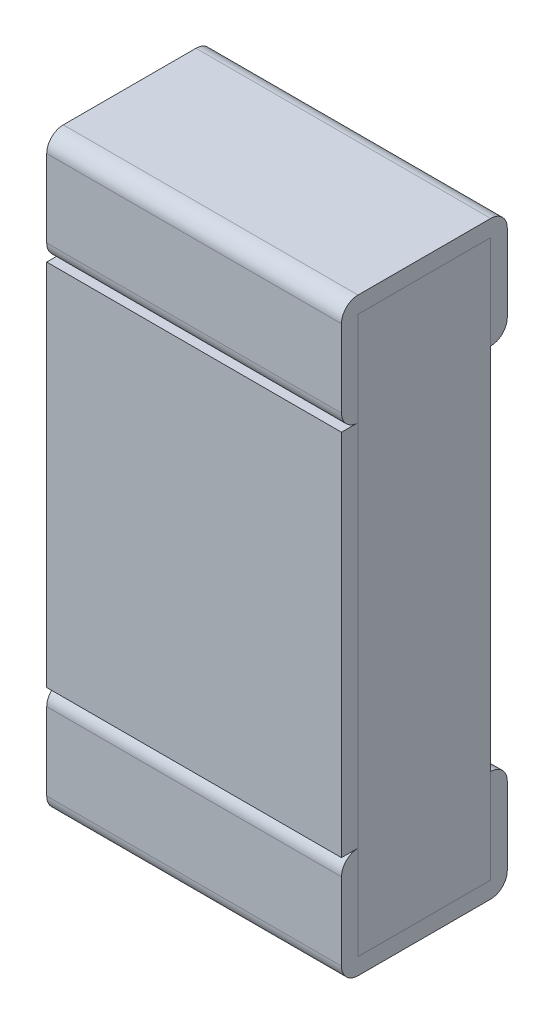
ISO-10303-21;
HEADER;
FILE_DESCRIPTION(('STEP AP214'),'2;1');
FILE_NAME('part.step','',(''),(''),'','','');
FILE_SCHEMA(('AUTOMOTIVE_DESIGN { 1 0 10303 214 1 1 1 1 }'));
ENDSEC;
DATA;
#1=APPLICATION_CONTEXT('core data for automotive mechanical design processes');
#2=APPLICATION_PROTOCOL_DEFINITION('international standard','automotive_design',2000,#1);
#3=PRODUCT_CONTEXT('',#1,'mechanical');
#4=PRODUCT('Part','Part','',(#3));
#5=PRODUCT_RELATED_PRODUCT_CATEGORY('part','',(#4));
#6=PRODUCT_DEFINITION_FORMATION('','',#4);
#7=PRODUCT_DEFINITION_CONTEXT('part definition',#1,'design');
#8=PRODUCT_DEFINITION('design','',#6,#7);
#9=PRODUCT_DEFINITION_SHAPE('','',#8);
#10=(LENGTH_UNIT() NAMED_UNIT(*) SI_UNIT(.MILLI.,.METRE.));
#11=(NAMED_UNIT(*) PLANE_ANGLE_UNIT() SI_UNIT($,.RADIAN.));
#12=(NAMED_UNIT(*) SI_UNIT($,.STERADIAN.) SOLID_ANGLE_UNIT());
#13=UNCERTAINTY_MEASURE_WITH_UNIT(LENGTH_MEASURE(1.E-05),#10,'distance_accuracy_value','');
#14=(GEOMETRIC_REPRESENTATION_CONTEXT(3) GLOBAL_UNCERTAINTY_ASSIGNED_CONTEXT((#13)) GLOBAL_UNIT_ASSIGNED_CONTEXT((#10,
#11,#12)) REPRESENTATION_CONTEXT('',''));
#15=CARTESIAN_POINT('',(0.,0.,0.));
#16=DIRECTION('',(0.,0.,1.));
#17=DIRECTION('',(1.,0.,0.));
#18=AXIS2_PLACEMENT_3D('',#15,#16,#17);
#19=CARTESIAN_POINT('',(144.404744279938,105.48804329235,142.661582908599));
#20=DIRECTION('',(0.,0.,1.));
#21=DIRECTION('',(1.,0.,0.));
#22=AXIS2_PLACEMENT_3D('',#19,#20,#21);
#23=PLANE('',#22);
#24=DIRECTION('',(-1.,0.,0.));
#25=VECTOR('',#24,1.);
#26=CARTESIAN_POINT('',(144.404744279938,105.48804329235,142.661582908599));
#27=LINE('',#26,#25);
#28=CARTESIAN_POINT('',(144.404744279938,105.48804329235,142.661582908599));
#29=VERTEX_POINT('',#28);
#30=CARTESIAN_POINT('',(143.604744279938,105.48804329235,142.661582908599));
#31=VERTEX_POINT('',#30);
#32=EDGE_CURVE('E67',#29,#31,#27,.T.);
#33=ORIENTED_EDGE('',*,*,#32,.F.);
#34=DIRECTION('',(0.,1.,0.));
#35=VECTOR('',#34,1.);
#36=CARTESIAN_POINT('',(144.404744279938,105.48804329235,142.661582908599));
#37=LINE('',#36,#35);
#38=CARTESIAN_POINT('',(144.404744279938,106.48804329235,142.661582908599));
#39=VERTEX_POINT('',#38);
#40=EDGE_CURVE('E11',#29,#39,#37,.T.);
#41=ORIENTED_EDGE('',*,*,#40,.T.);
#42=DIRECTION('',(-1.,0.,0.));
#43=VECTOR('',#42,1.);
#44=CARTESIAN_POINT('',(144.404744279938,106.48804329235,142.661582908599));
#45=LINE('',#44,#43);
#46=CARTESIAN_POINT('',(143.604744279938,106.48804329235,142.661582908599));
#47=VERTEX_POINT('',#46);
#48=EDGE_CURVE('E55',#39,#47,#45,.T.);
#49=ORIENTED_EDGE('',*,*,#48,.T.);
#50=DIRECTION('',(0.,1.,0.));
#51=VECTOR('',#50,1.);
#52=CARTESIAN_POINT('',(143.604744279938,105.48804329235,142.661582908599));
#53=LINE('',#52,#51);
#54=EDGE_CURVE('E413',#31,#47,#53,.T.);
#55=ORIENTED_EDGE('',*,*,#54,.F.);
#56=EDGE_LOOP('',(#33,#41,#49,#55));
#57=FACE_BOUND('',#56,.T.);
#58=ADVANCED_FACE('F44',(#57),#23,.T.);
#59=CARTESIAN_POINT('',(144.404744279938,106.48804329235,142.616582908599));
#60=DIRECTION('',(0.,1.,0.));
#61=DIRECTION('',(1.,0.,0.));
#62=AXIS2_PLACEMENT_3D('',#59,#60,#61);
#63=PLANE('',#62);
#64=DIRECTION('',(0.,0.,1.));
#65=VECTOR('',#64,1.);
#66=CARTESIAN_POINT('',(144.404744279938,106.48804329235,142.616582908599));
#67=LINE('',#66,#65);
#68=CARTESIAN_POINT('',(144.404744279938,106.48804329235,142.616582908599));
#69=VERTEX_POINT('',#68);
#70=EDGE_CURVE('E332',#69,#39,#67,.T.);
#71=ORIENTED_EDGE('',*,*,#70,.F.);
#72=DIRECTION('',(-1.,0.,0.));
#73=VECTOR('',#72,1.);
#74=CARTESIAN_POINT('',(144.404744279938,106.48804329235,142.616582908599));
#75=LINE('',#74,#73);
#76=CARTESIAN_POINT('',(143.604744279938,106.48804329235,142.616582908599));
#77=VERTEX_POINT('',#76);
#78=EDGE_CURVE('E403',#69,#77,#75,.T.);
#79=ORIENTED_EDGE('',*,*,#78,.T.);
#80=DIRECTION('',(0.,0.,1.));
#81=VECTOR('',#80,1.);
#82=CARTESIAN_POINT('',(143.604744279938,106.48804329235,142.616582908599));
#83=LINE('',#82,#81);
#84=EDGE_CURVE('E399',#77,#47,#83,.T.);
#85=ORIENTED_EDGE('',*,*,#84,.T.);
#86=ORIENTED_EDGE('',*,*,#48,.F.);
#87=EDGE_LOOP('',(#71,#79,#85,#86));
#88=FACE_BOUND('',#87,.T.);
#89=ADVANCED_FACE('F517',(#88),#63,.T.);
#90=CARTESIAN_POINT('',(144.404744279938,106.53304329235,142.616582908599));
#91=DIRECTION('',(-1.,0.,0.));
#92=DIRECTION('',(0.,-1.,0.));
#93=AXIS2_PLACEMENT_3D('',#90,#91,#92);
#94=CYLINDRICAL_SURFACE('',#93,0.0450000000000034);
#95=CARTESIAN_POINT('',(144.404744279938,106.53304329235,142.616582908599));
#96=DIRECTION('',(-1.,0.,0.));
#97=DIRECTION('',(0.,0.,1.));
#98=AXIS2_PLACEMENT_3D('',#95,#96,#97);
#99=CIRCLE('',#98,0.0449999999999895);
#100=CARTESIAN_POINT('',(144.404744279938,106.53304329235,142.661582908599));
#101=VERTEX_POINT('',#100);
#102=EDGE_CURVE('E260',#69,#101,#99,.T.);
#103=ORIENTED_EDGE('',*,*,#102,.T.);
#104=DIRECTION('',(-1.,0.,0.));
#105=VECTOR('',#104,1.);
#106=CARTESIAN_POINT('',(144.404744279938,106.53304329235,142.661582908599));
#107=LINE('',#106,#105);
#108=CARTESIAN_POINT('',(143.604744279938,106.53304329235,142.661582908599));
#109=VERTEX_POINT('',#108);
#110=EDGE_CURVE('E312',#101,#109,#107,.T.);
#111=ORIENTED_EDGE('',*,*,#110,.T.);
#112=CARTESIAN_POINT('',(143.604744279938,106.53304329235,142.616582908599));
#113=DIRECTION('',(-1.,0.,0.));
#114=DIRECTION('',(0.,0.,1.));
#115=AXIS2_PLACEMENT_3D('',#112,#113,#114);
#116=CIRCLE('',#115,0.0449999999999895);
#117=EDGE_CURVE('E392',#77,#109,#116,.T.);
#118=ORIENTED_EDGE('',*,*,#117,.F.);
#119=ORIENTED_EDGE('',*,*,#78,.F.);
#120=EDGE_LOOP('',(#103,#111,#118,#119));
#121=FACE_BOUND('',#120,.T.);
#122=ADVANCED_FACE('F514',(#121),#94,.T.);
#123=CARTESIAN_POINT('',(144.404744279938,106.48804329235,142.661582908599));
#124=DIRECTION('',(0.,0.,1.));
#125=DIRECTION('',(1.,0.,0.));
#126=AXIS2_PLACEMENT_3D('',#123,#124,#125);
#127=PLANE('',#126);
#128=DIRECTION('',(0.,1.,0.));
#129=VECTOR('',#128,1.);
#130=CARTESIAN_POINT('',(143.604744279938,106.48804329235,142.661582908599));
#131=LINE('',#130,#129);
#132=CARTESIAN_POINT('',(143.604744279938,106.74304329235,142.661582908599));
#133=VERTEX_POINT('',#132);
#134=EDGE_CURVE('E396',#109,#133,#131,.T.);
#135=ORIENTED_EDGE('',*,*,#134,.F.);
#136=ORIENTED_EDGE('',*,*,#110,.F.);
#137=DIRECTION('',(0.,1.,0.));
#138=VECTOR('',#137,1.);
#139=CARTESIAN_POINT('',(144.404744279938,106.48804329235,142.661582908599));
#140=LINE('',#139,#138);
#141=CARTESIAN_POINT('',(144.404744279938,106.74304329235,142.661582908599));
#142=VERTEX_POINT('',#141);
#143=EDGE_CURVE('E290',#101,#142,#140,.T.);
#144=ORIENTED_EDGE('',*,*,#143,.T.);
#145=DIRECTION('',(-1.,0.,0.));
#146=VECTOR('',#145,1.);
#147=CARTESIAN_POINT('',(144.404744279938,106.74304329235,142.661582908599));
#148=LINE('',#147,#146);
#149=EDGE_CURVE('E287',#142,#133,#148,.T.);
#150=ORIENTED_EDGE('',*,*,#149,.T.);
#151=EDGE_LOOP('',(#135,#136,#144,#150));
#152=FACE_BOUND('',#151,.T.);
#153=ADVANCED_FACE('F500',(#152),#127,.T.);
#154=CARTESIAN_POINT('',(144.404744279938,106.74304329235,142.616582908599));
#155=DIRECTION('',(-1.,0.,0.));
#156=DIRECTION('',(0.,1.,0.));
#157=AXIS2_PLACEMENT_3D('',#154,#155,#156);
#158=CYLINDRICAL_SURFACE('',#157,0.0450000000000034);
#159=DIRECTION('',(-1.,0.,0.));
#160=VECTOR('',#159,1.);
#161=CARTESIAN_POINT('',(144.404744279938,106.78804329235,142.616582908599));
#162=LINE('',#161,#160);
#163=CARTESIAN_POINT('',(144.404744279938,106.78804329235,142.616582908599));
#164=VERTEX_POINT('',#163);
#165=CARTESIAN_POINT('',(143.604744279938,106.78804329235,142.616582908599));
#166=VERTEX_POINT('',#165);
#167=EDGE_CURVE('E291',#164,#166,#162,.T.);
#168=ORIENTED_EDGE('',*,*,#167,.T.);
#169=CARTESIAN_POINT('',(143.604744279938,106.74304329235,142.616582908599));
#170=DIRECTION('',(1.,0.,0.));
#171=DIRECTION('',(0.,0.,1.));
#172=AXIS2_PLACEMENT_3D('',#169,#170,#171);
#173=CIRCLE('',#172,0.0449999999999895);
#174=EDGE_CURVE('E382',#166,#133,#173,.T.);
#175=ORIENTED_EDGE('',*,*,#174,.T.);
#176=ORIENTED_EDGE('',*,*,#149,.F.);
#177=CARTESIAN_POINT('',(144.404744279938,106.74304329235,142.616582908599));
#178=DIRECTION('',(1.,0.,0.));
#179=DIRECTION('',(0.,0.,1.));
#180=AXIS2_PLACEMENT_3D('',#177,#178,#179);
#181=CIRCLE('',#180,0.0449999999999895);
#182=EDGE_CURVE('E265',#164,#142,#181,.T.);
#183=ORIENTED_EDGE('',*,*,#182,.F.);
#184=EDGE_LOOP('',(#168,#175,#176,#183));
#185=FACE_BOUND('',#184,.T.);
#186=ADVANCED_FACE('F504',(#185),#158,.T.);
#187=CARTESIAN_POINT('',(144.404744279938,106.78804329235,142.211582908599));
#188=DIRECTION('',(0.,1.,0.));
#189=DIRECTION('',(1.,0.,0.));
#190=AXIS2_PLACEMENT_3D('',#187,#188,#189);
#191=PLANE('',#190);
#192=DIRECTION('',(0.,0.,1.));
#193=VECTOR('',#192,1.);
#194=CARTESIAN_POINT('',(144.404744279938,106.78804329235,142.211582908599));
#195=LINE('',#194,#193);
#196=CARTESIAN_POINT('',(144.404744279938,106.78804329235,142.256582908599));
#197=VERTEX_POINT('',#196);
#198=EDGE_CURVE('E351',#197,#164,#195,.T.);
#199=ORIENTED_EDGE('',*,*,#198,.F.);
#200=DIRECTION('',(-1.,0.,0.));
#201=VECTOR('',#200,1.);
#202=CARTESIAN_POINT('',(144.404744279938,106.78804329235,142.256582908599));
#203=LINE('',#202,#201);
#204=CARTESIAN_POINT('',(143.604744279938,106.78804329235,142.256582908599));
#205=VERTEX_POINT('',#204);
#206=EDGE_CURVE('E378',#197,#205,#203,.T.);
#207=ORIENTED_EDGE('',*,*,#206,.T.);
#208=DIRECTION('',(0.,0.,1.));
#209=VECTOR('',#208,1.);
#210=CARTESIAN_POINT('',(143.604744279938,106.78804329235,142.211582908599));
#211=LINE('',#210,#209);
#212=EDGE_CURVE('E306',#205,#166,#211,.T.);
#213=ORIENTED_EDGE('',*,*,#212,.T.);
#214=ORIENTED_EDGE('',*,*,#167,.F.);
#215=EDGE_LOOP('',(#199,#207,#213,#214));
#216=FACE_BOUND('',#215,.T.);
#217=ADVANCED_FACE('F46',(#216),#191,.T.);
#218=CARTESIAN_POINT('',(144.404744279938,106.74304329235,142.256582908599));
#219=DIRECTION('',(-1.,0.,0.));
#220=DIRECTION('',(0.,1.,0.));
#221=AXIS2_PLACEMENT_3D('',#218,#219,#220);
#222=CYLINDRICAL_SURFACE('',#221,0.0450000000000034);
#223=CARTESIAN_POINT('',(144.404744279938,106.74304329235,142.256582908599));
#224=DIRECTION('',(-1.,0.,0.));
#225=DIRECTION('',(0.,0.,1.));
#226=AXIS2_PLACEMENT_3D('',#223,#224,#225);
#227=CIRCLE('',#226,0.0449999999999895);
#228=CARTESIAN_POINT('',(144.404744279938,106.74304329235,142.211582908599));
#229=VERTEX_POINT('',#228);
#230=EDGE_CURVE('E302',#197,#229,#227,.T.);
#231=ORIENTED_EDGE('',*,*,#230,.T.);
#232=DIRECTION('',(-1.,0.,0.));
#233=VECTOR('',#232,1.);
#234=CARTESIAN_POINT('',(144.404744279938,106.74304329235,142.211582908599));
#235=LINE('',#234,#233);
#236=CARTESIAN_POINT('',(143.604744279938,106.74304329235,142.211582908599));
#237=VERTEX_POINT('',#236);
#238=EDGE_CURVE('E307',#229,#237,#235,.T.);
#239=ORIENTED_EDGE('',*,*,#238,.T.);
#240=CARTESIAN_POINT('',(143.604744279938,106.74304329235,142.256582908599));
#241=DIRECTION('',(-1.,0.,0.));
#242=DIRECTION('',(0.,0.,1.));
#243=AXIS2_PLACEMENT_3D('',#240,#241,#242);
#244=CIRCLE('',#243,0.0449999999999895);
#245=EDGE_CURVE('E339',#205,#237,#244,.T.);
#246=ORIENTED_EDGE('',*,*,#245,.F.);
#247=ORIENTED_EDGE('',*,*,#206,.F.);
#248=EDGE_LOOP('',(#231,#239,#246,#247));
#249=FACE_BOUND('',#248,.T.);
#250=ADVANCED_FACE('F561',(#249),#222,.T.);
#251=CARTESIAN_POINT('',(144.404744279938,106.48804329235,142.211582908599));
#252=DIRECTION('',(0.,0.,1.));
#253=DIRECTION('',(1.,0.,0.));
#254=AXIS2_PLACEMENT_3D('',#251,#252,#253);
#255=PLANE('',#254);
#256=ORIENTED_EDGE('',*,*,#238,.F.);
#257=DIRECTION('',(0.,1.,0.));
#258=VECTOR('',#257,1.);
#259=CARTESIAN_POINT('',(144.404744279938,106.48804329235,142.211582908599));
#260=LINE('',#259,#258);
#261=CARTESIAN_POINT('',(144.404744279938,106.53304329235,142.211582908599));
#262=VERTEX_POINT('',#261);
#263=EDGE_CURVE('E319',#262,#229,#260,.T.);
#264=ORIENTED_EDGE('',*,*,#263,.F.);
#265=DIRECTION('',(-1.,0.,0.));
#266=VECTOR('',#265,1.);
#267=CARTESIAN_POINT('',(144.404744279938,106.53304329235,142.211582908599));
#268=LINE('',#267,#266);
#269=CARTESIAN_POINT('',(143.604744279938,106.53304329235,142.211582908599));
#270=VERTEX_POINT('',#269);
#271=EDGE_CURVE('E358',#262,#270,#268,.T.);
#272=ORIENTED_EDGE('',*,*,#271,.T.);
#273=DIRECTION('',(0.,1.,0.));
#274=VECTOR('',#273,1.);
#275=CARTESIAN_POINT('',(143.604744279938,106.48804329235,142.211582908599));
#276=LINE('',#275,#274);
#277=EDGE_CURVE('E421',#270,#237,#276,.T.);
#278=ORIENTED_EDGE('',*,*,#277,.T.);
#279=EDGE_LOOP('',(#256,#264,#272,#278));
#280=FACE_BOUND('',#279,.T.);
#281=ADVANCED_FACE('F559',(#280),#255,.F.);
#282=CARTESIAN_POINT('',(144.404744279938,106.53304329235,142.256582908599));
#283=DIRECTION('',(-1.,0.,0.));
#284=DIRECTION('',(0.,-1.,0.));
#285=AXIS2_PLACEMENT_3D('',#282,#283,#284);
#286=CYLINDRICAL_SURFACE('',#285,0.0450000000000034);
#287=DIRECTION('',(-1.,0.,0.));
#288=VECTOR('',#287,1.);
#289=CARTESIAN_POINT('',(144.404744279938,106.48804329235,142.256582908599));
#290=LINE('',#289,#288);
#291=CARTESIAN_POINT('',(144.404744279938,106.48804329235,142.256582908599));
#292=VERTEX_POINT('',#291);
#293=CARTESIAN_POINT('',(143.604744279938,106.48804329235,142.256582908599));
#294=VERTEX_POINT('',#293);
#295=EDGE_CURVE('E456',#292,#294,#290,.T.);
#296=ORIENTED_EDGE('',*,*,#295,.T.);
#297=CARTESIAN_POINT('',(143.604744279938,106.53304329235,142.256582908599));
#298=DIRECTION('',(1.,0.,0.));
#299=DIRECTION('',(0.,0.,1.));
#300=AXIS2_PLACEMENT_3D('',#297,#298,#299);
#301=CIRCLE('',#300,0.0449999999999895);
#302=EDGE_CURVE('E465',#294,#270,#301,.T.);
#303=ORIENTED_EDGE('',*,*,#302,.T.);
#304=ORIENTED_EDGE('',*,*,#271,.F.);
#305=CARTESIAN_POINT('',(144.404744279938,106.53304329235,142.256582908599));
#306=DIRECTION('',(1.,0.,0.));
#307=DIRECTION('',(0.,0.,1.));
#308=AXIS2_PLACEMENT_3D('',#305,#306,#307);
#309=CIRCLE('',#308,0.0449999999999895);
#310=EDGE_CURVE('E266',#292,#262,#309,.T.);
#311=ORIENTED_EDGE('',*,*,#310,.F.);
#312=EDGE_LOOP('',(#296,#303,#304,#311));
#313=FACE_BOUND('',#312,.T.);
#314=ADVANCED_FACE('F555',(#313),#286,.T.);
#315=CARTESIAN_POINT('',(143.604744279938,105.48804329235,142.616582908599));
#316=DIRECTION('',(-1.,0.,0.));
#317=DIRECTION('',(0.,0.,1.));
#318=AXIS2_PLACEMENT_3D('',#315,#316,#317);
#319=PLANE('',#318);
#320=DIRECTION('',(0.,1.,0.));
#321=VECTOR('',#320,1.);
#322=CARTESIAN_POINT('',(143.604744279938,105.48804329235,142.616582908599));
#323=LINE('',#322,#321);
#324=CARTESIAN_POINT('',(143.604744279938,105.48804329235,142.616582908599));
#325=VERTEX_POINT('',#324);
#326=EDGE_CURVE('E387',#325,#77,#323,.T.);
#327=ORIENTED_EDGE('',*,*,#326,.F.);
#328=DIRECTION('',(0.,0.,1.));
#329=VECTOR('',#328,1.);
#330=CARTESIAN_POINT('',(143.604744279938,105.48804329235,142.616582908599));
#331=LINE('',#330,#329);
#332=EDGE_CURVE('E461',#325,#31,#331,.T.);
#333=ORIENTED_EDGE('',*,*,#332,.T.);
#334=ORIENTED_EDGE('',*,*,#54,.T.);
#335=ORIENTED_EDGE('',*,*,#84,.F.);
#336=EDGE_LOOP('',(#327,#333,#334,#335));
#337=FACE_BOUND('',#336,.T.);
#338=ADVANCED_FACE('F648',(#337),#319,.T.);
#339=CARTESIAN_POINT('',(143.604744279938,106.48804329235,142.211582908599));
#340=DIRECTION('',(-1.,0.,0.));
#341=DIRECTION('',(0.,0.,1.));
#342=AXIS2_PLACEMENT_3D('',#339,#340,#341);
#343=PLANE('',#342);
#344=ORIENTED_EDGE('',*,*,#277,.F.);
#345=ORIENTED_EDGE('',*,*,#302,.F.);
#346=DIRECTION('',(0.,1.,0.));
#347=VECTOR('',#346,1.);
#348=CARTESIAN_POINT('',(143.604744279938,105.23304329235,142.256582908599));
#349=LINE('',#348,#347);
#350=CARTESIAN_POINT('',(143.604744279938,106.74304329235,142.256582908599));
#351=VERTEX_POINT('',#350);
#352=EDGE_CURVE('E410',#294,#351,#349,.T.);
#353=ORIENTED_EDGE('',*,*,#352,.T.);
#354=DIRECTION('',(0.,0.,1.));
#355=VECTOR('',#354,1.);
#356=CARTESIAN_POINT('',(143.604744279938,106.74304329235,142.256582908599));
#357=LINE('',#356,#355);
#358=CARTESIAN_POINT('',(143.604744279938,106.74304329235,142.616582908599));
#359=VERTEX_POINT('',#358);
#360=EDGE_CURVE('E395',#351,#359,#357,.T.);
#361=ORIENTED_EDGE('',*,*,#360,.T.);
#362=DIRECTION('',(0.,1.,0.));
#363=VECTOR('',#362,1.);
#364=CARTESIAN_POINT('',(143.604744279938,105.23304329235,142.616582908599));
#365=LINE('',#364,#363);
#366=EDGE_CURVE('E383',#77,#359,#365,.T.);
#367=ORIENTED_EDGE('',*,*,#366,.F.);
#368=ORIENTED_EDGE('',*,*,#117,.T.);
#369=ORIENTED_EDGE('',*,*,#134,.T.);
#370=ORIENTED_EDGE('',*,*,#174,.F.);
#371=ORIENTED_EDGE('',*,*,#212,.F.);
#372=ORIENTED_EDGE('',*,*,#245,.T.);
#373=EDGE_LOOP('',(#344,#345,#353,#361,#367,#368,#369,#370,#371,#372));
#374=FACE_BOUND('',#373,.T.);
#375=ADVANCED_FACE('F509',(#374),#343,.T.);
#376=CARTESIAN_POINT('',(144.404744279938,105.48804329235,142.616582908599));
#377=DIRECTION('',(0.,1.,0.));
#378=DIRECTION('',(1.,0.,0.));
#379=AXIS2_PLACEMENT_3D('',#376,#377,#378);
#380=PLANE('',#379);
#381=ORIENTED_EDGE('',*,*,#32,.T.);
#382=ORIENTED_EDGE('',*,*,#332,.F.);
#383=DIRECTION('',(-1.,0.,0.));
#384=VECTOR('',#383,1.);
#385=CARTESIAN_POINT('',(144.404744279938,105.48804329235,142.616582908599));
#386=LINE('',#385,#384);
#387=CARTESIAN_POINT('',(144.404744279938,105.48804329235,142.616582908599));
#388=VERTEX_POINT('',#387);
#389=EDGE_CURVE('E388',#388,#325,#386,.T.);
#390=ORIENTED_EDGE('',*,*,#389,.F.);
#391=DIRECTION('',(0.,0.,1.));
#392=VECTOR('',#391,1.);
#393=CARTESIAN_POINT('',(144.404744279938,105.48804329235,142.616582908599));
#394=LINE('',#393,#392);
#395=EDGE_CURVE('E329',#388,#29,#394,.T.);
#396=ORIENTED_EDGE('',*,*,#395,.T.);
#397=EDGE_LOOP('',(#381,#382,#390,#396));
#398=FACE_BOUND('',#397,.T.);
#399=ADVANCED_FACE('F586',(#398),#380,.F.);
#400=CARTESIAN_POINT('',(144.404744279938,105.48804329235,142.616582908599));
#401=DIRECTION('',(-1.,0.,0.));
#402=DIRECTION('',(0.,0.,1.));
#403=AXIS2_PLACEMENT_3D('',#400,#401,#402);
#404=PLANE('',#403);
#405=ORIENTED_EDGE('',*,*,#70,.T.);
#406=ORIENTED_EDGE('',*,*,#40,.F.);
#407=ORIENTED_EDGE('',*,*,#395,.F.);
#408=DIRECTION('',(0.,1.,0.));
#409=VECTOR('',#408,1.);
#410=CARTESIAN_POINT('',(144.404744279938,105.48804329235,142.616582908599));
#411=LINE('',#410,#409);
#412=EDGE_CURVE('E343',#388,#69,#411,.T.);
#413=ORIENTED_EDGE('',*,*,#412,.T.);
#414=EDGE_LOOP('',(#405,#406,#407,#413));
#415=FACE_BOUND('',#414,.T.);
#416=ADVANCED_FACE('F518',(#415),#404,.F.);
#417=CARTESIAN_POINT('',(144.404744279938,106.48804329235,142.211582908599));
#418=DIRECTION('',(-1.,0.,0.));
#419=DIRECTION('',(0.,0.,1.));
#420=AXIS2_PLACEMENT_3D('',#417,#418,#419);
#421=PLANE('',#420);
#422=ORIENTED_EDGE('',*,*,#230,.F.);
#423=ORIENTED_EDGE('',*,*,#198,.T.);
#424=ORIENTED_EDGE('',*,*,#182,.T.);
#425=ORIENTED_EDGE('',*,*,#143,.F.);
#426=ORIENTED_EDGE('',*,*,#102,.F.);
#427=DIRECTION('',(0.,1.,0.));
#428=VECTOR('',#427,1.);
#429=CARTESIAN_POINT('',(144.404744279938,105.23304329235,142.616582908599));
#430=LINE('',#429,#428);
#431=CARTESIAN_POINT('',(144.404744279938,106.74304329235,142.616582908599));
#432=VERTEX_POINT('',#431);
#433=EDGE_CURVE('E252',#69,#432,#430,.T.);
#434=ORIENTED_EDGE('',*,*,#433,.T.);
#435=DIRECTION('',(0.,0.,1.));
#436=VECTOR('',#435,1.);
#437=CARTESIAN_POINT('',(144.404744279938,106.74304329235,142.256582908599));
#438=LINE('',#437,#436);
#439=CARTESIAN_POINT('',(144.404744279938,106.74304329235,142.256582908599));
#440=VERTEX_POINT('',#439);
#441=EDGE_CURVE('E256',#440,#432,#438,.T.);
#442=ORIENTED_EDGE('',*,*,#441,.F.);
#443=DIRECTION('',(0.,1.,0.));
#444=VECTOR('',#443,1.);
#445=CARTESIAN_POINT('',(144.404744279938,105.23304329235,142.256582908599));
#446=LINE('',#445,#444);
#447=EDGE_CURVE('E270',#292,#440,#446,.T.);
#448=ORIENTED_EDGE('',*,*,#447,.F.);
#449=ORIENTED_EDGE('',*,*,#310,.T.);
#450=ORIENTED_EDGE('',*,*,#263,.T.);
#451=EDGE_LOOP('',(#422,#423,#424,#425,#426,#434,#442,#448,#449,#450));
#452=FACE_BOUND('',#451,.T.);
#453=ADVANCED_FACE('F255',(#452),#421,.F.);
#454=CARTESIAN_POINT('',(144.404744279938,105.23304329235,142.256582908599));
#455=DIRECTION('',(0.,0.,1.));
#456=DIRECTION('',(1.,0.,0.));
#457=AXIS2_PLACEMENT_3D('',#454,#455,#456);
#458=PLANE('',#457);
#459=DIRECTION('',(0.,1.,0.));
#460=VECTOR('',#459,1.);
#461=CARTESIAN_POINT('',(143.604744279938,105.23304329235,142.256582908599));
#462=LINE('',#461,#460);
#463=CARTESIAN_POINT('',(143.604744279938,105.48804329235,142.256582908599));
#464=VERTEX_POINT('',#463);
#465=EDGE_CURVE('E328',#464,#294,#462,.T.);
#466=ORIENTED_EDGE('',*,*,#465,.T.);
#467=ORIENTED_EDGE('',*,*,#295,.F.);
#468=DIRECTION('',(0.,1.,0.));
#469=VECTOR('',#468,1.);
#470=CARTESIAN_POINT('',(144.404744279938,105.23304329235,142.256582908599));
#471=LINE('',#470,#469);
#472=CARTESIAN_POINT('',(144.404744279938,105.48804329235,142.256582908599));
#473=VERTEX_POINT('',#472);
#474=EDGE_CURVE('E278',#473,#292,#471,.T.);
#475=ORIENTED_EDGE('',*,*,#474,.F.);
#476=DIRECTION('',(-1.,0.,0.));
#477=VECTOR('',#476,1.);
#478=CARTESIAN_POINT('',(144.404744279938,105.48804329235,142.256582908599));
#479=LINE('',#478,#477);
#480=EDGE_CURVE('E407',#473,#464,#479,.T.);
#481=ORIENTED_EDGE('',*,*,#480,.T.);
#482=EDGE_LOOP('',(#466,#467,#475,#481));
#483=FACE_BOUND('',#482,.T.);
#484=ADVANCED_FACE('F551',(#483),#458,.F.);
#485=CARTESIAN_POINT('',(143.604744279938,105.23304329235,142.256582908599));
#486=DIRECTION('',(-1.,0.,0.));
#487=DIRECTION('',(0.,0.,1.));
#488=AXIS2_PLACEMENT_3D('',#485,#486,#487);
#489=PLANE('',#488);
#490=DIRECTION('',(0.,1.,0.));
#491=VECTOR('',#490,1.);
#492=CARTESIAN_POINT('',(143.604744279938,105.23304329235,142.256582908599));
#493=LINE('',#492,#491);
#494=CARTESIAN_POINT('',(143.604744279938,105.23304329235,142.256582908599));
#495=VERTEX_POINT('',#494);
#496=EDGE_CURVE('E308',#495,#464,#493,.T.);
#497=ORIENTED_EDGE('',*,*,#496,.F.);
#498=DIRECTION('',(0.,0.,1.));
#499=VECTOR('',#498,1.);
#500=CARTESIAN_POINT('',(143.604744279938,105.23304329235,142.256582908599));
#501=LINE('',#500,#499);
#502=CARTESIAN_POINT('',(143.604744279938,105.23304329235,142.616582908599));
#503=VERTEX_POINT('',#502);
#504=EDGE_CURVE('E48',#495,#503,#501,.T.);
#505=ORIENTED_EDGE('',*,*,#504,.T.);
#506=DIRECTION('',(0.,1.,0.));
#507=VECTOR('',#506,1.);
#508=CARTESIAN_POINT('',(143.604744279938,105.23304329235,142.616582908599));
#509=LINE('',#508,#507);
#510=EDGE_CURVE('E414',#503,#325,#509,.T.);
#511=ORIENTED_EDGE('',*,*,#510,.T.);
#512=ORIENTED_EDGE('',*,*,#326,.T.);
#513=ORIENTED_EDGE('',*,*,#366,.T.);
#514=ORIENTED_EDGE('',*,*,#360,.F.);
#515=ORIENTED_EDGE('',*,*,#352,.F.);
#516=ORIENTED_EDGE('',*,*,#465,.F.);
#517=EDGE_LOOP('',(#497,#505,#511,#512,#513,#514,#515,#516));
#518=FACE_BOUND('',#517,.T.);
#519=ADVANCED_FACE('F703',(#518),#489,.T.);
#520=CARTESIAN_POINT('',(144.404744279938,105.44304329235,142.616582908599));
#521=DIRECTION('',(-1.,0.,0.));
#522=DIRECTION('',(0.,1.,0.));
#523=AXIS2_PLACEMENT_3D('',#520,#521,#522);
#524=CYLINDRICAL_SURFACE('',#523,0.0450000000000034);
#525=ORIENTED_EDGE('',*,*,#389,.T.);
#526=CARTESIAN_POINT('',(143.604744279938,105.44304329235,142.616582908599));
#527=DIRECTION('',(1.,0.,0.));
#528=DIRECTION('',(0.,0.,1.));
#529=AXIS2_PLACEMENT_3D('',#526,#527,#528);
#530=CIRCLE('',#529,0.0449999999999895);
#531=CARTESIAN_POINT('',(143.604744279938,105.44304329235,142.661582908599));
#532=VERTEX_POINT('',#531);
#533=EDGE_CURVE('E324',#325,#532,#530,.T.);
#534=ORIENTED_EDGE('',*,*,#533,.T.);
#535=DIRECTION('',(-1.,0.,0.));
#536=VECTOR('',#535,1.);
#537=CARTESIAN_POINT('',(144.404744279938,105.44304329235,142.661582908599));
#538=LINE('',#537,#536);
#539=CARTESIAN_POINT('',(144.404744279938,105.44304329235,142.661582908599));
#540=VERTEX_POINT('',#539);
#541=EDGE_CURVE('E325',#540,#532,#538,.T.);
#542=ORIENTED_EDGE('',*,*,#541,.F.);
#543=CARTESIAN_POINT('',(144.404744279938,105.44304329235,142.616582908599));
#544=DIRECTION('',(1.,0.,0.));
#545=DIRECTION('',(0.,0.,1.));
#546=AXIS2_PLACEMENT_3D('',#543,#544,#545);
#547=CIRCLE('',#546,0.0449999999999895);
#548=EDGE_CURVE('E369',#388,#540,#547,.T.);
#549=ORIENTED_EDGE('',*,*,#548,.F.);
#550=EDGE_LOOP('',(#525,#534,#542,#549));
#551=FACE_BOUND('',#550,.T.);
#552=ADVANCED_FACE('F590',(#551),#524,.T.);
#553=CARTESIAN_POINT('',(144.404744279938,105.18804329235,142.661582908599));
#554=DIRECTION('',(0.,0.,1.));
#555=DIRECTION('',(1.,0.,0.));
#556=AXIS2_PLACEMENT_3D('',#553,#554,#555);
#557=PLANE('',#556);
#558=DIRECTION('',(0.,1.,0.));
#559=VECTOR('',#558,1.);
#560=CARTESIAN_POINT('',(143.604744279938,105.18804329235,142.661582908599));
#561=LINE('',#560,#559);
#562=CARTESIAN_POINT('',(143.604744279938,105.23304329235,142.661582908599));
#563=VERTEX_POINT('',#562);
#564=EDGE_CURVE('E310',#563,#532,#561,.T.);
#565=ORIENTED_EDGE('',*,*,#564,.F.);
#566=DIRECTION('',(-1.,0.,0.));
#567=VECTOR('',#566,1.);
#568=CARTESIAN_POINT('',(144.404744279938,105.23304329235,142.661582908599));
#569=LINE('',#568,#567);
#570=CARTESIAN_POINT('',(144.404744279938,105.23304329235,142.661582908599));
#571=VERTEX_POINT('',#570);
#572=EDGE_CURVE('E359',#571,#563,#569,.T.);
#573=ORIENTED_EDGE('',*,*,#572,.F.);
#574=DIRECTION('',(0.,1.,0.));
#575=VECTOR('',#574,1.);
#576=CARTESIAN_POINT('',(144.404744279938,105.18804329235,142.661582908599));
#577=LINE('',#576,#575);
#578=EDGE_CURVE('E320',#571,#540,#577,.T.);
#579=ORIENTED_EDGE('',*,*,#578,.T.);
#580=ORIENTED_EDGE('',*,*,#541,.T.);
#581=EDGE_LOOP('',(#565,#573,#579,#580));
#582=FACE_BOUND('',#581,.T.);
#583=ADVANCED_FACE('F587',(#582),#557,.T.);
#584=CARTESIAN_POINT('',(144.404744279938,105.23304329235,142.256582908599));
#585=DIRECTION('',(-1.,0.,0.));
#586=DIRECTION('',(0.,0.,1.));
#587=AXIS2_PLACEMENT_3D('',#584,#585,#586);
#588=PLANE('',#587);
#589=ORIENTED_EDGE('',*,*,#474,.T.);
#590=ORIENTED_EDGE('',*,*,#447,.T.);
#591=ORIENTED_EDGE('',*,*,#441,.T.);
#592=ORIENTED_EDGE('',*,*,#433,.F.);
#593=ORIENTED_EDGE('',*,*,#412,.F.);
#594=DIRECTION('',(0.,1.,0.));
#595=VECTOR('',#594,1.);
#596=CARTESIAN_POINT('',(144.404744279938,105.23304329235,142.616582908599));
#597=LINE('',#596,#595);
#598=CARTESIAN_POINT('',(144.404744279938,105.23304329235,142.616582908599));
#599=VERTEX_POINT('',#598);
#600=EDGE_CURVE('E373',#599,#388,#597,.T.);
#601=ORIENTED_EDGE('',*,*,#600,.F.);
#602=DIRECTION('',(0.,0.,1.));
#603=VECTOR('',#602,1.);
#604=CARTESIAN_POINT('',(144.404744279938,105.23304329235,142.256582908599));
#605=LINE('',#604,#603);
#606=CARTESIAN_POINT('',(144.404744279938,105.23304329235,142.256582908599));
#607=VERTEX_POINT('',#606);
#608=EDGE_CURVE('E367',#607,#599,#605,.T.);
#609=ORIENTED_EDGE('',*,*,#608,.F.);
#610=DIRECTION('',(0.,1.,0.));
#611=VECTOR('',#610,1.);
#612=CARTESIAN_POINT('',(144.404744279938,105.23304329235,142.256582908599));
#613=LINE('',#612,#611);
#614=EDGE_CURVE('E272',#607,#473,#613,.T.);
#615=ORIENTED_EDGE('',*,*,#614,.T.);
#616=EDGE_LOOP('',(#589,#590,#591,#592,#593,#601,#609,#615));
#617=FACE_BOUND('',#616,.T.);
#618=ADVANCED_FACE('F269',(#617),#588,.F.);
#619=CARTESIAN_POINT('',(144.404744279938,105.44304329235,142.256582908599));
#620=DIRECTION('',(-1.,0.,0.));
#621=DIRECTION('',(0.,1.,0.));
#622=AXIS2_PLACEMENT_3D('',#619,#620,#621);
#623=CYLINDRICAL_SURFACE('',#622,0.0450000000000034);
#624=CARTESIAN_POINT('',(144.404744279938,105.44304329235,142.256582908599));
#625=DIRECTION('',(-1.,0.,0.));
#626=DIRECTION('',(0.,0.,1.));
#627=AXIS2_PLACEMENT_3D('',#624,#625,#626);
#628=CIRCLE('',#627,0.0449999999999895);
#629=CARTESIAN_POINT('',(144.404744279938,105.44304329235,142.211582908599));
#630=VERTEX_POINT('',#629);
#631=EDGE_CURVE('E281',#473,#630,#628,.T.);
#632=ORIENTED_EDGE('',*,*,#631,.T.);
#633=DIRECTION('',(-1.,0.,0.));
#634=VECTOR('',#633,1.);
#635=CARTESIAN_POINT('',(144.404744279938,105.44304329235,142.211582908599));
#636=LINE('',#635,#634);
#637=CARTESIAN_POINT('',(143.604744279938,105.44304329235,142.211582908599));
#638=VERTEX_POINT('',#637);
#639=EDGE_CURVE('E214',#630,#638,#636,.T.);
#640=ORIENTED_EDGE('',*,*,#639,.T.);
#641=CARTESIAN_POINT('',(143.604744279938,105.44304329235,142.256582908599));
#642=DIRECTION('',(-1.,0.,0.));
#643=DIRECTION('',(0.,0.,1.));
#644=AXIS2_PLACEMENT_3D('',#641,#642,#643);
#645=CIRCLE('',#644,0.0449999999999895);
#646=EDGE_CURVE('E223',#464,#638,#645,.T.);
#647=ORIENTED_EDGE('',*,*,#646,.F.);
#648=ORIENTED_EDGE('',*,*,#480,.F.);
#649=EDGE_LOOP('',(#632,#640,#647,#648));
#650=FACE_BOUND('',#649,.T.);
#651=ADVANCED_FACE('F547',(#650),#623,.T.);
#652=CARTESIAN_POINT('',(144.404744279938,105.18804329235,142.211582908599));
#653=DIRECTION('',(0.,0.,1.));
#654=DIRECTION('',(1.,0.,0.));
#655=AXIS2_PLACEMENT_3D('',#652,#653,#654);
#656=PLANE('',#655);
#657=ORIENTED_EDGE('',*,*,#639,.F.);
#658=DIRECTION('',(0.,1.,0.));
#659=VECTOR('',#658,1.);
#660=CARTESIAN_POINT('',(144.404744279938,105.18804329235,142.211582908599));
#661=LINE('',#660,#659);
#662=CARTESIAN_POINT('',(144.404744279938,105.23304329235,142.211582908599));
#663=VERTEX_POINT('',#662);
#664=EDGE_CURVE('E292',#663,#630,#661,.T.);
#665=ORIENTED_EDGE('',*,*,#664,.F.);
#666=DIRECTION('',(-1.,0.,0.));
#667=VECTOR('',#666,1.);
#668=CARTESIAN_POINT('',(144.404744279938,105.23304329235,142.211582908599));
#669=LINE('',#668,#667);
#670=CARTESIAN_POINT('',(143.604744279938,105.23304329235,142.211582908599));
#671=VERTEX_POINT('',#670);
#672=EDGE_CURVE('E300',#663,#671,#669,.T.);
#673=ORIENTED_EDGE('',*,*,#672,.T.);
#674=DIRECTION('',(0.,1.,0.));
#675=VECTOR('',#674,1.);
#676=CARTESIAN_POINT('',(143.604744279938,105.18804329235,142.211582908599));
#677=LINE('',#676,#675);
#678=EDGE_CURVE('E136',#671,#638,#677,.T.);
#679=ORIENTED_EDGE('',*,*,#678,.T.);
#680=EDGE_LOOP('',(#657,#665,#673,#679));
#681=FACE_BOUND('',#680,.T.);
#682=ADVANCED_FACE('F429',(#681),#656,.F.);
#683=CARTESIAN_POINT('',(143.604744279938,105.18804329235,142.211582908599));
#684=DIRECTION('',(-1.,0.,0.));
#685=DIRECTION('',(0.,0.,1.));
#686=AXIS2_PLACEMENT_3D('',#683,#684,#685);
#687=PLANE('',#686);
#688=ORIENTED_EDGE('',*,*,#678,.F.);
#689=CARTESIAN_POINT('',(143.604744279938,105.23304329235,142.256582908599));
#690=DIRECTION('',(1.,0.,0.));
#691=DIRECTION('',(0.,0.,1.));
#692=AXIS2_PLACEMENT_3D('',#689,#690,#691);
#693=CIRCLE('',#692,0.0449999999999895);
#694=CARTESIAN_POINT('',(143.604744279938,105.18804329235,142.256582908599));
#695=VERTEX_POINT('',#694);
#696=EDGE_CURVE('E149',#695,#671,#693,.T.);
#697=ORIENTED_EDGE('',*,*,#696,.F.);
#698=DIRECTION('',(0.,0.,1.));
#699=VECTOR('',#698,1.);
#700=CARTESIAN_POINT('',(143.604744279938,105.18804329235,142.211582908599));
#701=LINE('',#700,#699);
#702=CARTESIAN_POINT('',(143.604744279938,105.18804329235,142.616582908599));
#703=VERTEX_POINT('',#702);
#704=EDGE_CURVE('E301',#695,#703,#701,.T.);
#705=ORIENTED_EDGE('',*,*,#704,.T.);
#706=CARTESIAN_POINT('',(143.604744279938,105.23304329235,142.616582908599));
#707=DIRECTION('',(-1.,0.,0.));
#708=DIRECTION('',(0.,0.,1.));
#709=AXIS2_PLACEMENT_3D('',#706,#707,#708);
#710=CIRCLE('',#709,0.0449999999999895);
#711=EDGE_CURVE('E365',#703,#563,#710,.T.);
#712=ORIENTED_EDGE('',*,*,#711,.T.);
#713=ORIENTED_EDGE('',*,*,#564,.T.);
#714=ORIENTED_EDGE('',*,*,#533,.F.);
#715=ORIENTED_EDGE('',*,*,#510,.F.);
#716=ORIENTED_EDGE('',*,*,#504,.F.);
#717=ORIENTED_EDGE('',*,*,#496,.T.);
#718=ORIENTED_EDGE('',*,*,#646,.T.);
#719=EDGE_LOOP('',(#688,#697,#705,#712,#713,#714,#715,#716,#717,#718));
#720=FACE_BOUND('',#719,.T.);
#721=ADVANCED_FACE('F594',(#720),#687,.T.);
#722=CARTESIAN_POINT('',(144.404744279938,105.23304329235,142.616582908599));
#723=DIRECTION('',(-1.,0.,0.));
#724=DIRECTION('',(0.,-1.,0.));
#725=AXIS2_PLACEMENT_3D('',#722,#723,#724);
#726=CYLINDRICAL_SURFACE('',#725,0.0450000000000034);
#727=CARTESIAN_POINT('',(144.404744279938,105.23304329235,142.616582908599));
#728=DIRECTION('',(-1.,0.,0.));
#729=DIRECTION('',(0.,0.,1.));
#730=AXIS2_PLACEMENT_3D('',#727,#728,#729);
#731=CIRCLE('',#730,0.0449999999999895);
#732=CARTESIAN_POINT('',(144.404744279938,105.18804329235,142.616582908599));
#733=VERTEX_POINT('',#732);
#734=EDGE_CURVE('E362',#733,#571,#731,.T.);
#735=ORIENTED_EDGE('',*,*,#734,.T.);
#736=ORIENTED_EDGE('',*,*,#572,.T.);
#737=ORIENTED_EDGE('',*,*,#711,.F.);
#738=DIRECTION('',(-1.,0.,0.));
#739=VECTOR('',#738,1.);
#740=CARTESIAN_POINT('',(144.404744279938,105.18804329235,142.616582908599));
#741=LINE('',#740,#739);
#742=EDGE_CURVE('E297',#733,#703,#741,.T.);
#743=ORIENTED_EDGE('',*,*,#742,.F.);
#744=EDGE_LOOP('',(#735,#736,#737,#743));
#745=FACE_BOUND('',#744,.T.);
#746=ADVANCED_FACE('F597',(#745),#726,.T.);
#747=CARTESIAN_POINT('',(144.404744279938,105.23304329235,142.256582908599));
#748=DIRECTION('',(-1.,0.,0.));
#749=DIRECTION('',(0.,-1.,0.));
#750=AXIS2_PLACEMENT_3D('',#747,#748,#749);
#751=CYLINDRICAL_SURFACE('',#750,0.0450000000000034);
#752=DIRECTION('',(-1.,0.,0.));
#753=VECTOR('',#752,1.);
#754=CARTESIAN_POINT('',(144.404744279938,105.18804329235,142.256582908599));
#755=LINE('',#754,#753);
#756=CARTESIAN_POINT('',(144.404744279938,105.18804329235,142.256582908599));
#757=VERTEX_POINT('',#756);
#758=EDGE_CURVE('E285',#757,#695,#755,.T.);
#759=ORIENTED_EDGE('',*,*,#758,.T.);
#760=ORIENTED_EDGE('',*,*,#696,.T.);
#761=ORIENTED_EDGE('',*,*,#672,.F.);
#762=CARTESIAN_POINT('',(144.404744279938,105.23304329235,142.256582908599));
#763=DIRECTION('',(1.,0.,0.));
#764=DIRECTION('',(0.,0.,1.));
#765=AXIS2_PLACEMENT_3D('',#762,#763,#764);
#766=CIRCLE('',#765,0.0449999999999895);
#767=EDGE_CURVE('E296',#757,#663,#766,.T.);
#768=ORIENTED_EDGE('',*,*,#767,.F.);
#769=EDGE_LOOP('',(#759,#760,#761,#768));
#770=FACE_BOUND('',#769,.T.);
#771=ADVANCED_FACE('F433',(#770),#751,.T.);
#772=CARTESIAN_POINT('',(144.404744279938,105.18804329235,142.211582908599));
#773=DIRECTION('',(-1.,0.,0.));
#774=DIRECTION('',(0.,0.,1.));
#775=AXIS2_PLACEMENT_3D('',#772,#773,#774);
#776=PLANE('',#775);
#777=ORIENTED_EDGE('',*,*,#631,.F.);
#778=ORIENTED_EDGE('',*,*,#614,.F.);
#779=ORIENTED_EDGE('',*,*,#608,.T.);
#780=ORIENTED_EDGE('',*,*,#600,.T.);
#781=ORIENTED_EDGE('',*,*,#548,.T.);
#782=ORIENTED_EDGE('',*,*,#578,.F.);
#783=ORIENTED_EDGE('',*,*,#734,.F.);
#784=DIRECTION('',(0.,0.,1.));
#785=VECTOR('',#784,1.);
#786=CARTESIAN_POINT('',(144.404744279938,105.18804329235,142.211582908599));
#787=LINE('',#786,#785);
#788=EDGE_CURVE('E377',#757,#733,#787,.T.);
#789=ORIENTED_EDGE('',*,*,#788,.F.);
#790=ORIENTED_EDGE('',*,*,#767,.T.);
#791=ORIENTED_EDGE('',*,*,#664,.T.);
#792=EDGE_LOOP('',(#777,#778,#779,#780,#781,#782,#783,#789,#790,#791));
#793=FACE_BOUND('',#792,.T.);
#794=ADVANCED_FACE('F443',(#793),#776,.F.);
#795=CARTESIAN_POINT('',(144.404744279938,105.18804329235,142.211582908599));
#796=DIRECTION('',(0.,1.,0.));
#797=DIRECTION('',(1.,0.,0.));
#798=AXIS2_PLACEMENT_3D('',#795,#796,#797);
#799=PLANE('',#798);
#800=ORIENTED_EDGE('',*,*,#742,.T.);
#801=ORIENTED_EDGE('',*,*,#704,.F.);
#802=ORIENTED_EDGE('',*,*,#758,.F.);
#803=ORIENTED_EDGE('',*,*,#788,.T.);
#804=EDGE_LOOP('',(#800,#801,#802,#803));
#805=FACE_BOUND('',#804,.T.);
#806=ADVANCED_FACE('F439',(#805),#799,.F.);
#807=CLOSED_SHELL('',(#58,#89,#122,#153,#186,#217,#250,#281,#314,#338,#375,#399,#416,#453,#484,
#519,#552,#583,#618,#651,#682,#721,#746,#771,#794,#806));
#808=MANIFOLD_SOLID_BREP('B2',#807);
#809=ADVANCED_BREP_SHAPE_REPRESENTATION('',(#18,#808),#14);
#810=SHAPE_DEFINITION_REPRESENTATION(#9,#809);
ENDSEC;
END-ISO-10303-21;
